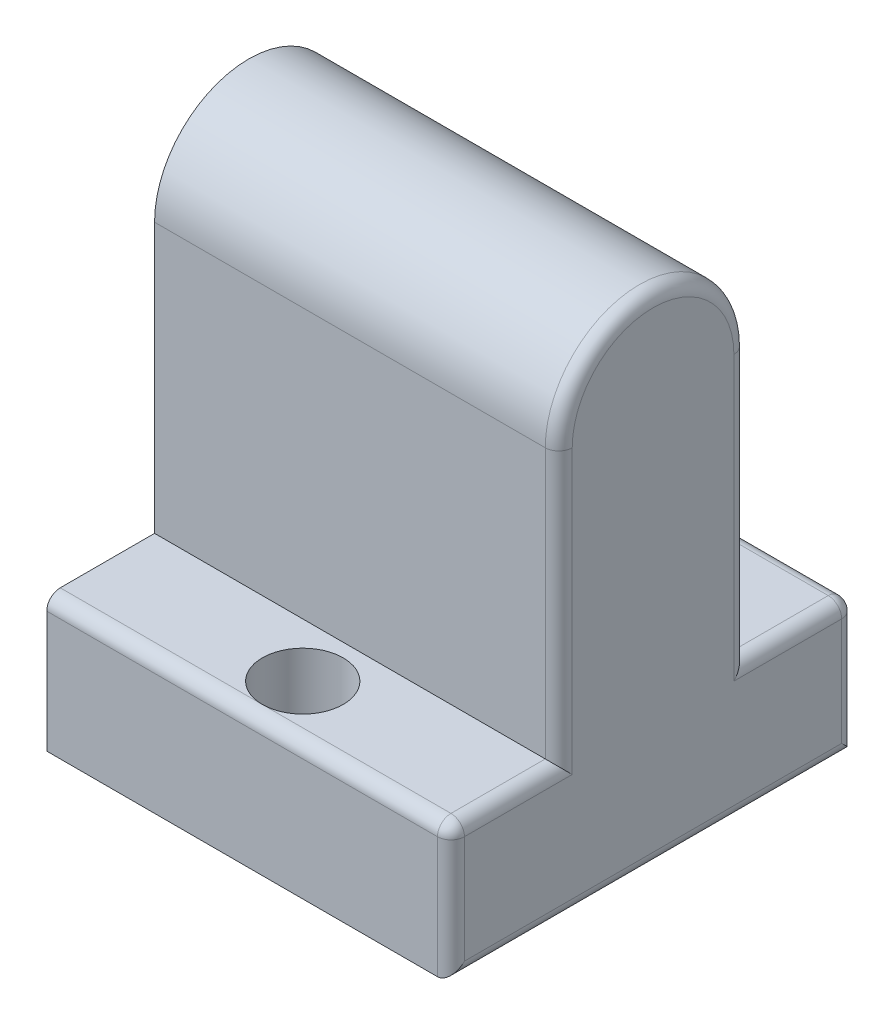
ISO-10303-21;
HEADER;
FILE_DESCRIPTION(('STEP AP214'),'2;1');
FILE_NAME('part.step','',(''),(''),'','','');
FILE_SCHEMA(('AUTOMOTIVE_DESIGN { 1 0 10303 214 1 1 1 1 }'));
ENDSEC;
DATA;
#1=APPLICATION_CONTEXT('core data for automotive mechanical design processes');
#2=APPLICATION_PROTOCOL_DEFINITION('international standard','automotive_design',2000,#1);
#3=PRODUCT_CONTEXT('',#1,'mechanical');
#4=PRODUCT('Part','Part','',(#3));
#5=PRODUCT_RELATED_PRODUCT_CATEGORY('part','',(#4));
#6=PRODUCT_DEFINITION_FORMATION('','',#4);
#7=PRODUCT_DEFINITION_CONTEXT('part definition',#1,'design');
#8=PRODUCT_DEFINITION('design','',#6,#7);
#9=PRODUCT_DEFINITION_SHAPE('','',#8);
#10=(LENGTH_UNIT() NAMED_UNIT(*) SI_UNIT(.MILLI.,.METRE.));
#11=(NAMED_UNIT(*) PLANE_ANGLE_UNIT() SI_UNIT($,.RADIAN.));
#12=(NAMED_UNIT(*) SI_UNIT($,.STERADIAN.) SOLID_ANGLE_UNIT());
#13=UNCERTAINTY_MEASURE_WITH_UNIT(LENGTH_MEASURE(1.E-05),#10,'distance_accuracy_value','');
#14=(GEOMETRIC_REPRESENTATION_CONTEXT(3) GLOBAL_UNCERTAINTY_ASSIGNED_CONTEXT((#13)) GLOBAL_UNIT_ASSIGNED_CONTEXT((#10,
#11,#12)) REPRESENTATION_CONTEXT('',''));
#15=CARTESIAN_POINT('',(0.,0.,0.));
#16=DIRECTION('',(0.,0.,1.));
#17=DIRECTION('',(1.,0.,0.));
#18=AXIS2_PLACEMENT_3D('',#15,#16,#17);
#19=CARTESIAN_POINT('',(30.,0.,0.));
#20=DIRECTION('',(-1.,0.,0.));
#21=DIRECTION('',(0.,0.,1.));
#22=AXIS2_PLACEMENT_3D('',#19,#20,#21);
#23=CYLINDRICAL_SURFACE('',#22,4.);
#24=CARTESIAN_POINT('',(0.,0.,0.));
#25=DIRECTION('',(1.,0.,0.));
#26=DIRECTION('',(0.,0.,-1.));
#27=AXIS2_PLACEMENT_3D('',#24,#25,#26);
#28=CIRCLE('',#27,4.);
#29=CARTESIAN_POINT('',(0.,0.,-4.));
#30=VERTEX_POINT('',#29);
#31=EDGE_CURVE('E162',#30,#30,#28,.T.);
#32=ORIENTED_EDGE('',*,*,#31,.F.);
#33=EDGE_LOOP('',(#32));
#34=FACE_BOUND('',#33,.T.);
#35=CARTESIAN_POINT('',(25.,0.,0.));
#36=DIRECTION('',(1.,0.,0.));
#37=DIRECTION('',(0.,0.,-1.));
#38=AXIS2_PLACEMENT_3D('',#35,#36,#37);
#39=CIRCLE('',#38,4.);
#40=CARTESIAN_POINT('',(25.,0.,-4.));
#41=VERTEX_POINT('',#40);
#42=EDGE_CURVE('E274',#41,#41,#39,.T.);
#43=ORIENTED_EDGE('',*,*,#42,.T.);
#44=EDGE_LOOP('',(#43));
#45=FACE_BOUND('',#44,.T.);
#46=ADVANCED_FACE('F33',(#34,#45),#23,.F.);
#47=CARTESIAN_POINT('',(30.,0.,0.));
#48=DIRECTION('',(1.,0.,0.));
#49=DIRECTION('',(0.,0.,-1.));
#50=AXIS2_PLACEMENT_3D('',#47,#48,#49);
#51=PLANE('',#50);
#52=DIRECTION('',(0.,0.,1.));
#53=VECTOR('',#52,1.);
#54=CARTESIAN_POINT('',(30.,-21.,0.));
#55=LINE('',#54,#53);
#56=CARTESIAN_POINT('',(30.,-21.,-14.));
#57=VERTEX_POINT('',#56);
#58=CARTESIAN_POINT('',(30.,-21.,-6.));
#59=VERTEX_POINT('',#58);
#60=EDGE_CURVE('E210',#57,#59,#55,.T.);
#61=ORIENTED_EDGE('',*,*,#60,.T.);
#62=DIRECTION('',(0.,1.,0.));
#63=VECTOR('',#62,1.);
#64=CARTESIAN_POINT('',(30.,0.,-6.));
#65=LINE('',#64,#63);
#66=CARTESIAN_POINT('',(30.,0.,-6.));
#67=VERTEX_POINT('',#66);
#68=EDGE_CURVE('E212',#59,#67,#65,.T.);
#69=ORIENTED_EDGE('',*,*,#68,.T.);
#70=CARTESIAN_POINT('',(30.,0.,0.));
#71=DIRECTION('',(1.,0.,0.));
#72=DIRECTION('',(0.,0.,-1.));
#73=AXIS2_PLACEMENT_3D('',#70,#71,#72);
#74=CIRCLE('',#73,6.);
#75=CARTESIAN_POINT('',(30.,0.,6.));
#76=VERTEX_POINT('',#75);
#77=EDGE_CURVE('E198',#67,#76,#74,.T.);
#78=ORIENTED_EDGE('',*,*,#77,.T.);
#79=DIRECTION('',(0.,-1.,0.));
#80=VECTOR('',#79,1.);
#81=CARTESIAN_POINT('',(30.,-20.,6.));
#82=LINE('',#81,#80);
#83=CARTESIAN_POINT('',(30.,-21.,6.));
#84=VERTEX_POINT('',#83);
#85=EDGE_CURVE('E200',#76,#84,#82,.T.);
#86=ORIENTED_EDGE('',*,*,#85,.T.);
#87=DIRECTION('',(0.,0.,1.));
#88=VECTOR('',#87,1.);
#89=CARTESIAN_POINT('',(30.,-21.,0.));
#90=LINE('',#89,#88);
#91=CARTESIAN_POINT('',(30.,-21.,14.));
#92=VERTEX_POINT('',#91);
#93=EDGE_CURVE('E202',#84,#92,#90,.T.);
#94=ORIENTED_EDGE('',*,*,#93,.T.);
#95=DIRECTION('',(0.,1.,0.));
#96=VECTOR('',#95,1.);
#97=CARTESIAN_POINT('',(30.,-30.,14.));
#98=LINE('',#97,#96);
#99=CARTESIAN_POINT('',(30.,-29.,14.));
#100=VERTEX_POINT('',#99);
#101=EDGE_CURVE('E204',#92,#100,#98,.F.);
#102=ORIENTED_EDGE('',*,*,#101,.T.);
#103=DIRECTION('',(0.,0.,1.));
#104=VECTOR('',#103,1.);
#105=CARTESIAN_POINT('',(30.,-29.,-15.));
#106=LINE('',#105,#104);
#107=CARTESIAN_POINT('',(30.,-29.,-14.));
#108=VERTEX_POINT('',#107);
#109=EDGE_CURVE('E206',#100,#108,#106,.F.);
#110=ORIENTED_EDGE('',*,*,#109,.T.);
#111=DIRECTION('',(0.,1.,0.));
#112=VECTOR('',#111,1.);
#113=CARTESIAN_POINT('',(30.,-20.,-14.));
#114=LINE('',#113,#112);
#115=EDGE_CURVE('E208',#108,#57,#114,.T.);
#116=ORIENTED_EDGE('',*,*,#115,.T.);
#117=EDGE_LOOP('',(#61,#69,#78,#86,#94,#102,#110,#116));
#118=FACE_BOUND('',#117,.T.);
#119=ADVANCED_FACE('F347',(#118),#51,.T.);
#120=CARTESIAN_POINT('',(0.,0.,0.));
#121=DIRECTION('',(1.,0.,0.));
#122=DIRECTION('',(0.,0.,-1.));
#123=AXIS2_PLACEMENT_3D('',#120,#121,#122);
#124=PLANE('',#123);
#125=DIRECTION('',(0.,0.,-1.));
#126=VECTOR('',#125,1.);
#127=CARTESIAN_POINT('',(0.,-20.,-15.));
#128=LINE('',#127,#126);
#129=CARTESIAN_POINT('',(0.,-20.,-7.));
#130=VERTEX_POINT('',#129);
#131=CARTESIAN_POINT('',(0.,-20.,-14.));
#132=VERTEX_POINT('',#131);
#133=EDGE_CURVE('E176',#130,#132,#128,.T.);
#134=ORIENTED_EDGE('',*,*,#133,.T.);
#135=CARTESIAN_POINT('',(0.,-21.,-14.));
#136=DIRECTION('',(1.,0.,0.));
#137=DIRECTION('',(0.,0.,-1.));
#138=AXIS2_PLACEMENT_3D('',#135,#136,#137);
#139=CIRCLE('',#138,1.);
#140=CARTESIAN_POINT('',(0.,-21.,-15.));
#141=VERTEX_POINT('',#140);
#142=EDGE_CURVE('E11',#132,#141,#139,.F.);
#143=ORIENTED_EDGE('',*,*,#142,.T.);
#144=DIRECTION('',(0.,1.,0.));
#145=VECTOR('',#144,1.);
#146=CARTESIAN_POINT('',(0.,-30.,-15.));
#147=LINE('',#146,#145);
#148=CARTESIAN_POINT('',(0.,-30.,-15.));
#149=VERTEX_POINT('',#148);
#150=EDGE_CURVE('E163',#149,#141,#147,.T.);
#151=ORIENTED_EDGE('',*,*,#150,.F.);
#152=DIRECTION('',(0.,0.,-1.));
#153=VECTOR('',#152,1.);
#154=CARTESIAN_POINT('',(0.,-30.,-15.));
#155=LINE('',#154,#153);
#156=CARTESIAN_POINT('',(0.,-30.,15.));
#157=VERTEX_POINT('',#156);
#158=EDGE_CURVE('E147',#157,#149,#155,.T.);
#159=ORIENTED_EDGE('',*,*,#158,.F.);
#160=DIRECTION('',(0.,1.,0.));
#161=VECTOR('',#160,1.);
#162=CARTESIAN_POINT('',(0.,-30.,15.));
#163=LINE('',#162,#161);
#164=CARTESIAN_POINT('',(0.,-21.,15.));
#165=VERTEX_POINT('',#164);
#166=EDGE_CURVE('E156',#157,#165,#163,.T.);
#167=ORIENTED_EDGE('',*,*,#166,.T.);
#168=CARTESIAN_POINT('',(0.,-21.,14.));
#169=DIRECTION('',(1.,0.,0.));
#170=DIRECTION('',(0.,0.,-1.));
#171=AXIS2_PLACEMENT_3D('',#168,#169,#170);
#172=CIRCLE('',#171,1.);
#173=CARTESIAN_POINT('',(0.,-20.,14.));
#174=VERTEX_POINT('',#173);
#175=EDGE_CURVE('E42',#165,#174,#172,.F.);
#176=ORIENTED_EDGE('',*,*,#175,.T.);
#177=CARTESIAN_POINT('',(0.,-20.,7.));
#178=VERTEX_POINT('',#177);
#179=EDGE_CURVE('E153',#174,#178,#128,.T.);
#180=ORIENTED_EDGE('',*,*,#179,.T.);
#181=DIRECTION('',(0.,-1.,0.));
#182=VECTOR('',#181,1.);
#183=CARTESIAN_POINT('',(0.,0.,7.));
#184=LINE('',#183,#182);
#185=CARTESIAN_POINT('',(0.,0.,7.));
#186=VERTEX_POINT('',#185);
#187=EDGE_CURVE('E183',#186,#178,#184,.T.);
#188=ORIENTED_EDGE('',*,*,#187,.F.);
#189=CARTESIAN_POINT('',(0.,0.,0.));
#190=DIRECTION('',(1.,0.,0.));
#191=DIRECTION('',(0.,0.,-1.));
#192=AXIS2_PLACEMENT_3D('',#189,#190,#191);
#193=CIRCLE('',#192,7.);
#194=CARTESIAN_POINT('',(0.,0.,-7.));
#195=VERTEX_POINT('',#194);
#196=EDGE_CURVE('E180',#195,#186,#193,.T.);
#197=ORIENTED_EDGE('',*,*,#196,.F.);
#198=DIRECTION('',(0.,1.,0.));
#199=VECTOR('',#198,1.);
#200=CARTESIAN_POINT('',(0.,0.,-7.));
#201=LINE('',#200,#199);
#202=EDGE_CURVE('E186',#130,#195,#201,.T.);
#203=ORIENTED_EDGE('',*,*,#202,.F.);
#204=EDGE_LOOP('',(#134,#143,#151,#159,#167,#176,#180,#188,#197,#203));
#205=FACE_BOUND('',#204,.T.);
#206=ORIENTED_EDGE('',*,*,#31,.T.);
#207=EDGE_LOOP('',(#206));
#208=FACE_BOUND('',#207,.T.);
#209=ADVANCED_FACE('F166',(#205,#208),#124,.F.);
#210=CARTESIAN_POINT('',(30.,0.,0.));
#211=DIRECTION('',(-1.,0.,0.));
#212=DIRECTION('',(0.,0.,1.));
#213=AXIS2_PLACEMENT_3D('',#210,#211,#212);
#214=CYLINDRICAL_SURFACE('',#213,7.);
#215=DIRECTION('',(-1.,0.,0.));
#216=VECTOR('',#215,1.);
#217=CARTESIAN_POINT('',(30.,0.,7.));
#218=LINE('',#217,#216);
#219=CARTESIAN_POINT('',(29.,0.,7.));
#220=VERTEX_POINT('',#219);
#221=EDGE_CURVE('E196',#220,#186,#218,.T.);
#222=ORIENTED_EDGE('',*,*,#221,.F.);
#223=CARTESIAN_POINT('',(29.,0.,0.));
#224=DIRECTION('',(1.,0.,0.));
#225=DIRECTION('',(0.,0.,-1.));
#226=AXIS2_PLACEMENT_3D('',#223,#224,#225);
#227=CIRCLE('',#226,7.);
#228=CARTESIAN_POINT('',(29.,0.,-7.));
#229=VERTEX_POINT('',#228);
#230=EDGE_CURVE('E238',#220,#229,#227,.F.);
#231=ORIENTED_EDGE('',*,*,#230,.T.);
#232=DIRECTION('',(-1.,0.,0.));
#233=VECTOR('',#232,1.);
#234=CARTESIAN_POINT('',(30.,0.,-7.));
#235=LINE('',#234,#233);
#236=EDGE_CURVE('E189',#229,#195,#235,.T.);
#237=ORIENTED_EDGE('',*,*,#236,.T.);
#238=ORIENTED_EDGE('',*,*,#196,.T.);
#239=EDGE_LOOP('',(#222,#231,#237,#238));
#240=FACE_BOUND('',#239,.T.);
#241=ADVANCED_FACE('F317',(#240),#214,.T.);
#242=CARTESIAN_POINT('',(30.,0.,7.));
#243=DIRECTION('',(0.,0.,-1.));
#244=DIRECTION('',(0.,1.,0.));
#245=AXIS2_PLACEMENT_3D('',#242,#243,#244);
#246=PLANE('',#245);
#247=DIRECTION('',(-1.,0.,0.));
#248=VECTOR('',#247,1.);
#249=CARTESIAN_POINT('',(30.,-20.,7.));
#250=LINE('',#249,#248);
#251=CARTESIAN_POINT('',(29.,-20.,7.));
#252=VERTEX_POINT('',#251);
#253=EDGE_CURVE('E193',#252,#178,#250,.T.);
#254=ORIENTED_EDGE('',*,*,#253,.F.);
#255=DIRECTION('',(0.,-1.,0.));
#256=VECTOR('',#255,1.);
#257=CARTESIAN_POINT('',(29.,0.,7.));
#258=LINE('',#257,#256);
#259=EDGE_CURVE('E50',#252,#220,#258,.F.);
#260=ORIENTED_EDGE('',*,*,#259,.T.);
#261=ORIENTED_EDGE('',*,*,#221,.T.);
#262=ORIENTED_EDGE('',*,*,#187,.T.);
#263=EDGE_LOOP('',(#254,#260,#261,#262));
#264=FACE_BOUND('',#263,.T.);
#265=ADVANCED_FACE('F312',(#264),#246,.F.);
#266=CARTESIAN_POINT('',(30.,0.,-7.));
#267=DIRECTION('',(0.,0.,1.));
#268=DIRECTION('',(0.,-1.,0.));
#269=AXIS2_PLACEMENT_3D('',#266,#267,#268);
#270=PLANE('',#269);
#271=ORIENTED_EDGE('',*,*,#236,.F.);
#272=DIRECTION('',(0.,1.,0.));
#273=VECTOR('',#272,1.);
#274=CARTESIAN_POINT('',(29.,-20.,-7.));
#275=LINE('',#274,#273);
#276=CARTESIAN_POINT('',(29.,-20.,-7.));
#277=VERTEX_POINT('',#276);
#278=EDGE_CURVE('E215',#229,#277,#275,.F.);
#279=ORIENTED_EDGE('',*,*,#278,.T.);
#280=DIRECTION('',(-1.,0.,0.));
#281=VECTOR('',#280,1.);
#282=CARTESIAN_POINT('',(30.,-20.,-7.));
#283=LINE('',#282,#281);
#284=EDGE_CURVE('E191',#277,#130,#283,.T.);
#285=ORIENTED_EDGE('',*,*,#284,.T.);
#286=ORIENTED_EDGE('',*,*,#202,.T.);
#287=EDGE_LOOP('',(#271,#279,#285,#286));
#288=FACE_BOUND('',#287,.T.);
#289=ADVANCED_FACE('F323',(#288),#270,.F.);
#290=CARTESIAN_POINT('',(0.,-20.,0.));
#291=DIRECTION('',(0.,1.,0.));
#292=DIRECTION('',(0.,0.,1.));
#293=AXIS2_PLACEMENT_3D('',#290,#291,#292);
#294=PLANE('',#293);
#295=ORIENTED_EDGE('',*,*,#284,.F.);
#296=DIRECTION('',(0.,0.,1.));
#297=VECTOR('',#296,1.);
#298=CARTESIAN_POINT('',(29.,-20.,0.));
#299=LINE('',#298,#297);
#300=CARTESIAN_POINT('',(29.,-20.,-14.));
#301=VERTEX_POINT('',#300);
#302=EDGE_CURVE('E222',#277,#301,#299,.F.);
#303=ORIENTED_EDGE('',*,*,#302,.T.);
#304=DIRECTION('',(1.,0.,0.));
#305=VECTOR('',#304,1.);
#306=CARTESIAN_POINT('',(0.,-20.,-14.));
#307=LINE('',#306,#305);
#308=CARTESIAN_POINT('',(15.,-20.,-14.));
#309=VERTEX_POINT('',#308);
#310=EDGE_CURVE('E220',#301,#309,#307,.F.);
#311=ORIENTED_EDGE('',*,*,#310,.T.);
#312=CARTESIAN_POINT('',(15.,-20.,-11.));
#313=DIRECTION('',(0.,1.,0.));
#314=DIRECTION('',(0.,0.,1.));
#315=AXIS2_PLACEMENT_3D('',#312,#313,#314);
#316=CIRCLE('',#315,3.);
#317=EDGE_CURVE('E289',#309,#309,#316,.T.);
#318=ORIENTED_EDGE('',*,*,#317,.F.);
#319=DIRECTION('',(1.,0.,0.));
#320=VECTOR('',#319,1.);
#321=CARTESIAN_POINT('',(0.,-20.,-14.));
#322=LINE('',#321,#320);
#323=EDGE_CURVE('E218',#309,#132,#322,.F.);
#324=ORIENTED_EDGE('',*,*,#323,.T.);
#325=ORIENTED_EDGE('',*,*,#133,.F.);
#326=EDGE_LOOP('',(#295,#303,#311,#318,#324,#325));
#327=FACE_BOUND('',#326,.T.);
#328=ADVANCED_FACE('F328',(#327),#294,.T.);
#329=CARTESIAN_POINT('',(0.,-30.,15.));
#330=DIRECTION('',(0.,0.,-1.));
#331=DIRECTION('',(-1.,0.,0.));
#332=AXIS2_PLACEMENT_3D('',#329,#330,#331);
#333=PLANE('',#332);
#334=DIRECTION('',(-1.,0.,0.));
#335=VECTOR('',#334,1.);
#336=CARTESIAN_POINT('',(0.,-30.,15.));
#337=LINE('',#336,#335);
#338=CARTESIAN_POINT('',(29.,-30.,15.));
#339=VERTEX_POINT('',#338);
#340=EDGE_CURVE('E142',#339,#157,#337,.T.);
#341=ORIENTED_EDGE('',*,*,#340,.F.);
#342=DIRECTION('',(0.,1.,0.));
#343=VECTOR('',#342,1.);
#344=CARTESIAN_POINT('',(29.,-20.,15.));
#345=LINE('',#344,#343);
#346=CARTESIAN_POINT('',(29.,-21.,15.));
#347=VERTEX_POINT('',#346);
#348=EDGE_CURVE('E230',#339,#347,#345,.T.);
#349=ORIENTED_EDGE('',*,*,#348,.T.);
#350=DIRECTION('',(-1.,0.,0.));
#351=VECTOR('',#350,1.);
#352=CARTESIAN_POINT('',(0.,-21.,15.));
#353=LINE('',#352,#351);
#354=EDGE_CURVE('E159',#347,#165,#353,.T.);
#355=ORIENTED_EDGE('',*,*,#354,.T.);
#356=ORIENTED_EDGE('',*,*,#166,.F.);
#357=EDGE_LOOP('',(#341,#349,#355,#356));
#358=FACE_BOUND('',#357,.T.);
#359=ADVANCED_FACE('F157',(#358),#333,.F.);
#360=CARTESIAN_POINT('',(0.,-30.,-15.));
#361=DIRECTION('',(0.,0.,1.));
#362=DIRECTION('',(1.,0.,0.));
#363=AXIS2_PLACEMENT_3D('',#360,#361,#362);
#364=PLANE('',#363);
#365=DIRECTION('',(1.,0.,0.));
#366=VECTOR('',#365,1.);
#367=CARTESIAN_POINT('',(30.,-21.,-15.));
#368=LINE('',#367,#366);
#369=CARTESIAN_POINT('',(29.,-21.,-15.));
#370=VERTEX_POINT('',#369);
#371=EDGE_CURVE('E224',#141,#370,#368,.T.);
#372=ORIENTED_EDGE('',*,*,#371,.T.);
#373=DIRECTION('',(0.,1.,0.));
#374=VECTOR('',#373,1.);
#375=CARTESIAN_POINT('',(29.,-30.,-15.));
#376=LINE('',#375,#374);
#377=CARTESIAN_POINT('',(29.,-30.,-15.));
#378=VERTEX_POINT('',#377);
#379=EDGE_CURVE('E226',#370,#378,#376,.F.);
#380=ORIENTED_EDGE('',*,*,#379,.T.);
#381=DIRECTION('',(1.,0.,0.));
#382=VECTOR('',#381,1.);
#383=CARTESIAN_POINT('',(0.,-30.,-15.));
#384=LINE('',#383,#382);
#385=EDGE_CURVE('E170',#149,#378,#384,.T.);
#386=ORIENTED_EDGE('',*,*,#385,.F.);
#387=ORIENTED_EDGE('',*,*,#150,.T.);
#388=EDGE_LOOP('',(#372,#380,#386,#387));
#389=FACE_BOUND('',#388,.T.);
#390=ADVANCED_FACE('F337',(#389),#364,.F.);
#391=CARTESIAN_POINT('',(0.,-30.,0.));
#392=DIRECTION('',(0.,1.,0.));
#393=DIRECTION('',(0.,0.,1.));
#394=AXIS2_PLACEMENT_3D('',#391,#392,#393);
#395=PLANE('',#394);
#396=CARTESIAN_POINT('',(15.,-30.,-11.));
#397=DIRECTION('',(0.,1.,0.));
#398=DIRECTION('',(0.,0.,1.));
#399=AXIS2_PLACEMENT_3D('',#396,#397,#398);
#400=CIRCLE('',#399,3.);
#401=CARTESIAN_POINT('',(15.,-30.,-7.99999999999999));
#402=VERTEX_POINT('',#401);
#403=EDGE_CURVE('E286',#402,#402,#400,.T.);
#404=ORIENTED_EDGE('',*,*,#403,.T.);
#405=EDGE_LOOP('',(#404));
#406=FACE_BOUND('',#405,.T.);
#407=CARTESIAN_POINT('',(15.,-30.,11.));
#408=DIRECTION('',(0.,1.,0.));
#409=DIRECTION('',(0.,0.,1.));
#410=AXIS2_PLACEMENT_3D('',#407,#408,#409);
#411=CIRCLE('',#410,3.);
#412=CARTESIAN_POINT('',(15.,-30.,14.));
#413=VERTEX_POINT('',#412);
#414=EDGE_CURVE('E284',#413,#413,#411,.T.);
#415=ORIENTED_EDGE('',*,*,#414,.T.);
#416=EDGE_LOOP('',(#415));
#417=FACE_BOUND('',#416,.T.);
#418=ORIENTED_EDGE('',*,*,#385,.T.);
#419=DIRECTION('',(0.,0.,1.));
#420=VECTOR('',#419,1.);
#421=CARTESIAN_POINT('',(29.,-30.,15.));
#422=LINE('',#421,#420);
#423=EDGE_CURVE('E150',#378,#339,#422,.T.);
#424=ORIENTED_EDGE('',*,*,#423,.T.);
#425=ORIENTED_EDGE('',*,*,#340,.T.);
#426=ORIENTED_EDGE('',*,*,#158,.T.);
#427=EDGE_LOOP('',(#418,#424,#425,#426));
#428=FACE_BOUND('',#427,.T.);
#429=ADVANCED_FACE('F145',(#406,#417,#428),#395,.F.);
#430=DIRECTION('',(-1.,0.,0.));
#431=VECTOR('',#430,1.);
#432=CARTESIAN_POINT('',(30.,-20.,14.));
#433=LINE('',#432,#431);
#434=CARTESIAN_POINT('',(15.,-20.,14.));
#435=VERTEX_POINT('',#434);
#436=CARTESIAN_POINT('',(29.,-20.,14.));
#437=VERTEX_POINT('',#436);
#438=EDGE_CURVE('E58',#435,#437,#433,.F.);
#439=ORIENTED_EDGE('',*,*,#438,.T.);
#440=DIRECTION('',(0.,0.,1.));
#441=VECTOR('',#440,1.);
#442=CARTESIAN_POINT('',(29.,-20.,0.));
#443=LINE('',#442,#441);
#444=EDGE_CURVE('E235',#437,#252,#443,.F.);
#445=ORIENTED_EDGE('',*,*,#444,.T.);
#446=ORIENTED_EDGE('',*,*,#253,.T.);
#447=ORIENTED_EDGE('',*,*,#179,.F.);
#448=DIRECTION('',(-1.,0.,0.));
#449=VECTOR('',#448,1.);
#450=CARTESIAN_POINT('',(30.,-20.,14.));
#451=LINE('',#450,#449);
#452=EDGE_CURVE('E233',#174,#435,#451,.F.);
#453=ORIENTED_EDGE('',*,*,#452,.T.);
#454=CARTESIAN_POINT('',(15.,-20.,11.));
#455=DIRECTION('',(0.,1.,0.));
#456=DIRECTION('',(0.,0.,1.));
#457=AXIS2_PLACEMENT_3D('',#454,#455,#456);
#458=CIRCLE('',#457,3.);
#459=EDGE_CURVE('E279',#435,#435,#458,.T.);
#460=ORIENTED_EDGE('',*,*,#459,.F.);
#461=EDGE_LOOP('',(#439,#445,#446,#447,#453,#460));
#462=FACE_BOUND('',#461,.T.);
#463=ADVANCED_FACE('F300',(#462),#294,.T.);
#464=CARTESIAN_POINT('',(15.,-30.,11.));
#465=DIRECTION('',(0.,1.,0.));
#466=DIRECTION('',(0.,0.,1.));
#467=AXIS2_PLACEMENT_3D('',#464,#465,#466);
#468=CYLINDRICAL_SURFACE('',#467,3.);
#469=ORIENTED_EDGE('',*,*,#414,.F.);
#470=EDGE_LOOP('',(#469));
#471=FACE_BOUND('',#470,.T.);
#472=ORIENTED_EDGE('',*,*,#459,.T.);
#473=EDGE_LOOP('',(#472));
#474=FACE_BOUND('',#473,.T.);
#475=ADVANCED_FACE('F296',(#471,#474),#468,.F.);
#476=CARTESIAN_POINT('',(15.,-30.,-11.));
#477=DIRECTION('',(0.,1.,0.));
#478=DIRECTION('',(0.,0.,1.));
#479=AXIS2_PLACEMENT_3D('',#476,#477,#478);
#480=CYLINDRICAL_SURFACE('',#479,3.);
#481=ORIENTED_EDGE('',*,*,#403,.F.);
#482=EDGE_LOOP('',(#481));
#483=FACE_BOUND('',#482,.T.);
#484=ORIENTED_EDGE('',*,*,#317,.T.);
#485=EDGE_LOOP('',(#484));
#486=FACE_BOUND('',#485,.T.);
#487=ADVANCED_FACE('F299',(#483,#486),#480,.F.);
#488=CARTESIAN_POINT('',(25.,0.,0.));
#489=DIRECTION('',(1.,0.,0.));
#490=DIRECTION('',(0.,0.,-1.));
#491=AXIS2_PLACEMENT_3D('',#488,#489,#490);
#492=PLANE('',#491);
#493=ORIENTED_EDGE('',*,*,#42,.F.);
#494=EDGE_LOOP('',(#493));
#495=FACE_BOUND('',#494,.T.);
#496=ADVANCED_FACE('F353',(#495),#492,.F.);
#497=CARTESIAN_POINT('',(29.,-30.,14.));
#498=DIRECTION('',(0.,-1.,0.));
#499=DIRECTION('',(0.,0.,-1.));
#500=AXIS2_PLACEMENT_3D('',#497,#498,#499);
#501=CYLINDRICAL_SURFACE('',#500,1.);
#502=CARTESIAN_POINT('',(29.,-21.,14.));
#503=DIRECTION('',(0.,1.,0.));
#504=DIRECTION('',(0.,0.,1.));
#505=AXIS2_PLACEMENT_3D('',#502,#503,#504);
#506=CIRCLE('',#505,1.);
#507=EDGE_CURVE('E268',#347,#92,#506,.T.);
#508=ORIENTED_EDGE('',*,*,#507,.F.);
#509=ORIENTED_EDGE('',*,*,#348,.F.);
#510=CARTESIAN_POINT('',(29.,-29.,14.));
#511=DIRECTION('',(0.,-0.707106781186547,-0.707106781186547));
#512=DIRECTION('',(0.,-0.707106781186547,0.707106781186547));
#513=AXIS2_PLACEMENT_3D('',#510,#511,#512);
#514=ELLIPSE('',#513,1.41421356237309,1.);
#515=EDGE_CURVE('E37',#100,#339,#514,.T.);
#516=ORIENTED_EDGE('',*,*,#515,.F.);
#517=ORIENTED_EDGE('',*,*,#101,.F.);
#518=EDGE_LOOP('',(#508,#509,#516,#517));
#519=FACE_BOUND('',#518,.T.);
#520=ADVANCED_FACE('F35',(#519),#501,.T.);
#521=CARTESIAN_POINT('',(0.,-21.,14.));
#522=DIRECTION('',(1.,0.,0.));
#523=DIRECTION('',(0.,0.,-1.));
#524=AXIS2_PLACEMENT_3D('',#521,#522,#523);
#525=CYLINDRICAL_SURFACE('',#524,1.);
#526=ORIENTED_EDGE('',*,*,#175,.F.);
#527=ORIENTED_EDGE('',*,*,#354,.F.);
#528=CARTESIAN_POINT('',(29.,-21.,14.));
#529=DIRECTION('',(1.,0.,0.));
#530=DIRECTION('',(0.,0.,-1.));
#531=AXIS2_PLACEMENT_3D('',#528,#529,#530);
#532=CIRCLE('',#531,1.);
#533=EDGE_CURVE('E266',#437,#347,#532,.T.);
#534=ORIENTED_EDGE('',*,*,#533,.F.);
#535=ORIENTED_EDGE('',*,*,#438,.F.);
#536=ORIENTED_EDGE('',*,*,#452,.F.);
#537=EDGE_LOOP('',(#526,#527,#534,#535,#536));
#538=FACE_BOUND('',#537,.T.);
#539=ADVANCED_FACE('F305',(#538),#525,.T.);
#540=CARTESIAN_POINT('',(29.,-29.,0.));
#541=DIRECTION('',(0.,0.,-1.));
#542=DIRECTION('',(-1.,0.,0.));
#543=AXIS2_PLACEMENT_3D('',#540,#541,#542);
#544=CYLINDRICAL_SURFACE('',#543,1.);
#545=ORIENTED_EDGE('',*,*,#515,.T.);
#546=ORIENTED_EDGE('',*,*,#423,.F.);
#547=CARTESIAN_POINT('',(29.,-29.,-14.));
#548=DIRECTION('',(0.,0.707106781186547,-0.707106781186547));
#549=DIRECTION('',(0.,-0.707106781186547,-0.707106781186547));
#550=AXIS2_PLACEMENT_3D('',#547,#548,#549);
#551=ELLIPSE('',#550,1.41421356237309,1.);
#552=EDGE_CURVE('E263',#108,#378,#551,.T.);
#553=ORIENTED_EDGE('',*,*,#552,.F.);
#554=ORIENTED_EDGE('',*,*,#109,.F.);
#555=EDGE_LOOP('',(#545,#546,#553,#554));
#556=FACE_BOUND('',#555,.T.);
#557=ADVANCED_FACE('F340',(#556),#544,.T.);
#558=CARTESIAN_POINT('',(29.,-21.,14.));
#559=DIRECTION('',(0.,0.,1.));
#560=DIRECTION('',(1.,0.,0.));
#561=AXIS2_PLACEMENT_3D('',#558,#559,#560);
#562=SPHERICAL_SURFACE('',#561,1.);
#563=ORIENTED_EDGE('',*,*,#533,.T.);
#564=ORIENTED_EDGE('',*,*,#507,.T.);
#565=CARTESIAN_POINT('',(29.,-21.,14.));
#566=DIRECTION('',(0.,0.,1.));
#567=DIRECTION('',(1.,0.,0.));
#568=AXIS2_PLACEMENT_3D('',#565,#566,#567);
#569=CIRCLE('',#568,1.);
#570=EDGE_CURVE('E260',#437,#92,#569,.F.);
#571=ORIENTED_EDGE('',*,*,#570,.F.);
#572=EDGE_LOOP('',(#563,#564,#571));
#573=FACE_BOUND('',#572,.T.);
#574=ADVANCED_FACE('F307',(#573),#562,.T.);
#575=CARTESIAN_POINT('',(0.,-21.,-14.));
#576=DIRECTION('',(-1.,0.,0.));
#577=DIRECTION('',(0.,0.,1.));
#578=AXIS2_PLACEMENT_3D('',#575,#576,#577);
#579=CYLINDRICAL_SURFACE('',#578,1.);
#580=ORIENTED_EDGE('',*,*,#323,.F.);
#581=ORIENTED_EDGE('',*,*,#310,.F.);
#582=CARTESIAN_POINT('',(29.,-21.,-14.));
#583=DIRECTION('',(1.,0.,0.));
#584=DIRECTION('',(0.,0.,-1.));
#585=AXIS2_PLACEMENT_3D('',#582,#583,#584);
#586=CIRCLE('',#585,1.);
#587=EDGE_CURVE('E257',#370,#301,#586,.T.);
#588=ORIENTED_EDGE('',*,*,#587,.F.);
#589=ORIENTED_EDGE('',*,*,#371,.F.);
#590=ORIENTED_EDGE('',*,*,#142,.F.);
#591=EDGE_LOOP('',(#580,#581,#588,#589,#590));
#592=FACE_BOUND('',#591,.T.);
#593=ADVANCED_FACE('F333',(#592),#579,.T.);
#594=CARTESIAN_POINT('',(29.,0.,-14.));
#595=DIRECTION('',(0.,-1.,0.));
#596=DIRECTION('',(0.,0.,-1.));
#597=AXIS2_PLACEMENT_3D('',#594,#595,#596);
#598=CYLINDRICAL_SURFACE('',#597,1.);
#599=ORIENTED_EDGE('',*,*,#552,.T.);
#600=ORIENTED_EDGE('',*,*,#379,.F.);
#601=CARTESIAN_POINT('',(29.,-21.,-14.));
#602=DIRECTION('',(0.,1.,0.));
#603=DIRECTION('',(0.,0.,1.));
#604=AXIS2_PLACEMENT_3D('',#601,#602,#603);
#605=CIRCLE('',#604,1.);
#606=EDGE_CURVE('E254',#57,#370,#605,.T.);
#607=ORIENTED_EDGE('',*,*,#606,.F.);
#608=ORIENTED_EDGE('',*,*,#115,.F.);
#609=EDGE_LOOP('',(#599,#600,#607,#608));
#610=FACE_BOUND('',#609,.T.);
#611=ADVANCED_FACE('F343',(#610),#598,.T.);
#612=CARTESIAN_POINT('',(29.,-21.,0.));
#613=DIRECTION('',(0.,0.,1.));
#614=DIRECTION('',(1.,0.,0.));
#615=AXIS2_PLACEMENT_3D('',#612,#613,#614);
#616=CYLINDRICAL_SURFACE('',#615,1.);
#617=ORIENTED_EDGE('',*,*,#570,.T.);
#618=ORIENTED_EDGE('',*,*,#93,.F.);
#619=CARTESIAN_POINT('',(29.,-21.,6.));
#620=DIRECTION('',(0.,-0.707106781186548,0.707106781186547));
#621=DIRECTION('',(0.,0.707106781186547,0.707106781186548));
#622=AXIS2_PLACEMENT_3D('',#619,#620,#621);
#623=ELLIPSE('',#622,1.4142135623731,1.);
#624=EDGE_CURVE('E251',#252,#84,#623,.F.);
#625=ORIENTED_EDGE('',*,*,#624,.F.);
#626=ORIENTED_EDGE('',*,*,#444,.F.);
#627=EDGE_LOOP('',(#617,#618,#625,#626));
#628=FACE_BOUND('',#627,.T.);
#629=ADVANCED_FACE('F311',(#628),#616,.T.);
#630=CARTESIAN_POINT('',(29.,-21.,-14.));
#631=DIRECTION('',(0.,0.,1.));
#632=DIRECTION('',(1.,0.,0.));
#633=AXIS2_PLACEMENT_3D('',#630,#631,#632);
#634=SPHERICAL_SURFACE('',#633,1.);
#635=ORIENTED_EDGE('',*,*,#606,.T.);
#636=ORIENTED_EDGE('',*,*,#587,.T.);
#637=CARTESIAN_POINT('',(29.,-21.,-14.));
#638=DIRECTION('',(0.,0.,-1.));
#639=DIRECTION('',(-1.,0.,0.));
#640=AXIS2_PLACEMENT_3D('',#637,#638,#639);
#641=CIRCLE('',#640,1.);
#642=EDGE_CURVE('E248',#57,#301,#641,.F.);
#643=ORIENTED_EDGE('',*,*,#642,.F.);
#644=EDGE_LOOP('',(#635,#636,#643));
#645=FACE_BOUND('',#644,.T.);
#646=ADVANCED_FACE('F394',(#645),#634,.T.);
#647=CARTESIAN_POINT('',(29.,0.,6.));
#648=DIRECTION('',(0.,1.,0.));
#649=DIRECTION('',(0.,0.,1.));
#650=AXIS2_PLACEMENT_3D('',#647,#648,#649);
#651=CYLINDRICAL_SURFACE('',#650,1.);
#652=ORIENTED_EDGE('',*,*,#624,.T.);
#653=ORIENTED_EDGE('',*,*,#85,.F.);
#654=CARTESIAN_POINT('',(29.,0.,6.));
#655=DIRECTION('',(0.,1.,0.));
#656=DIRECTION('',(0.,0.,1.));
#657=AXIS2_PLACEMENT_3D('',#654,#655,#656);
#658=CIRCLE('',#657,1.);
#659=EDGE_CURVE('E245',#220,#76,#658,.T.);
#660=ORIENTED_EDGE('',*,*,#659,.F.);
#661=ORIENTED_EDGE('',*,*,#259,.F.);
#662=EDGE_LOOP('',(#652,#653,#660,#661));
#663=FACE_BOUND('',#662,.T.);
#664=ADVANCED_FACE('F390',(#663),#651,.T.);
#665=CARTESIAN_POINT('',(29.,-21.,0.));
#666=DIRECTION('',(0.,0.,1.));
#667=DIRECTION('',(1.,0.,0.));
#668=AXIS2_PLACEMENT_3D('',#665,#666,#667);
#669=CYLINDRICAL_SURFACE('',#668,1.);
#670=ORIENTED_EDGE('',*,*,#642,.T.);
#671=ORIENTED_EDGE('',*,*,#302,.F.);
#672=CARTESIAN_POINT('',(29.,-21.,-6.));
#673=DIRECTION('',(0.,-0.707106781186548,-0.707106781186547));
#674=DIRECTION('',(0.,-0.707106781186547,0.707106781186548));
#675=AXIS2_PLACEMENT_3D('',#672,#673,#674);
#676=ELLIPSE('',#675,1.4142135623731,1.);
#677=EDGE_CURVE('E243',#59,#277,#676,.F.);
#678=ORIENTED_EDGE('',*,*,#677,.F.);
#679=ORIENTED_EDGE('',*,*,#60,.F.);
#680=EDGE_LOOP('',(#670,#671,#678,#679));
#681=FACE_BOUND('',#680,.T.);
#682=ADVANCED_FACE('F386',(#681),#669,.T.);
#683=CARTESIAN_POINT('',(29.,0.,0.));
#684=DIRECTION('',(1.,0.,0.));
#685=DIRECTION('',(0.,0.,-1.));
#686=AXIS2_PLACEMENT_3D('',#683,#684,#685);
#687=TOROIDAL_SURFACE('',#686,6.,1.);
#688=ORIENTED_EDGE('',*,*,#659,.T.);
#689=ORIENTED_EDGE('',*,*,#77,.F.);
#690=CARTESIAN_POINT('',(29.,0.,-6.));
#691=DIRECTION('',(0.,-1.,0.));
#692=DIRECTION('',(1.,0.,0.));
#693=AXIS2_PLACEMENT_3D('',#690,#691,#692);
#694=CIRCLE('',#693,1.);
#695=EDGE_CURVE('E241',#229,#67,#694,.T.);
#696=ORIENTED_EDGE('',*,*,#695,.F.);
#697=ORIENTED_EDGE('',*,*,#230,.F.);
#698=EDGE_LOOP('',(#688,#689,#696,#697));
#699=FACE_BOUND('',#698,.T.);
#700=ADVANCED_FACE('F382',(#699),#687,.T.);
#701=CARTESIAN_POINT('',(29.,0.,-6.));
#702=DIRECTION('',(0.,-1.,0.));
#703=DIRECTION('',(0.,0.,-1.));
#704=AXIS2_PLACEMENT_3D('',#701,#702,#703);
#705=CYLINDRICAL_SURFACE('',#704,1.);
#706=ORIENTED_EDGE('',*,*,#677,.T.);
#707=ORIENTED_EDGE('',*,*,#278,.F.);
#708=ORIENTED_EDGE('',*,*,#695,.T.);
#709=ORIENTED_EDGE('',*,*,#68,.F.);
#710=EDGE_LOOP('',(#706,#707,#708,#709));
#711=FACE_BOUND('',#710,.T.);
#712=ADVANCED_FACE('F379',(#711),#705,.T.);
#713=CLOSED_SHELL('',(#46,#119,#209,#241,#265,#289,#328,#359,#390,#429,#463,#475,#487,#496,#520,
#539,#557,#574,#593,#611,#629,#646,#664,#682,#700,#712));
#714=MANIFOLD_SOLID_BREP('B2',#713);
#715=ADVANCED_BREP_SHAPE_REPRESENTATION('',(#18,#714),#14);
#716=SHAPE_DEFINITION_REPRESENTATION(#9,#715);
ENDSEC;
END-ISO-10303-21;
